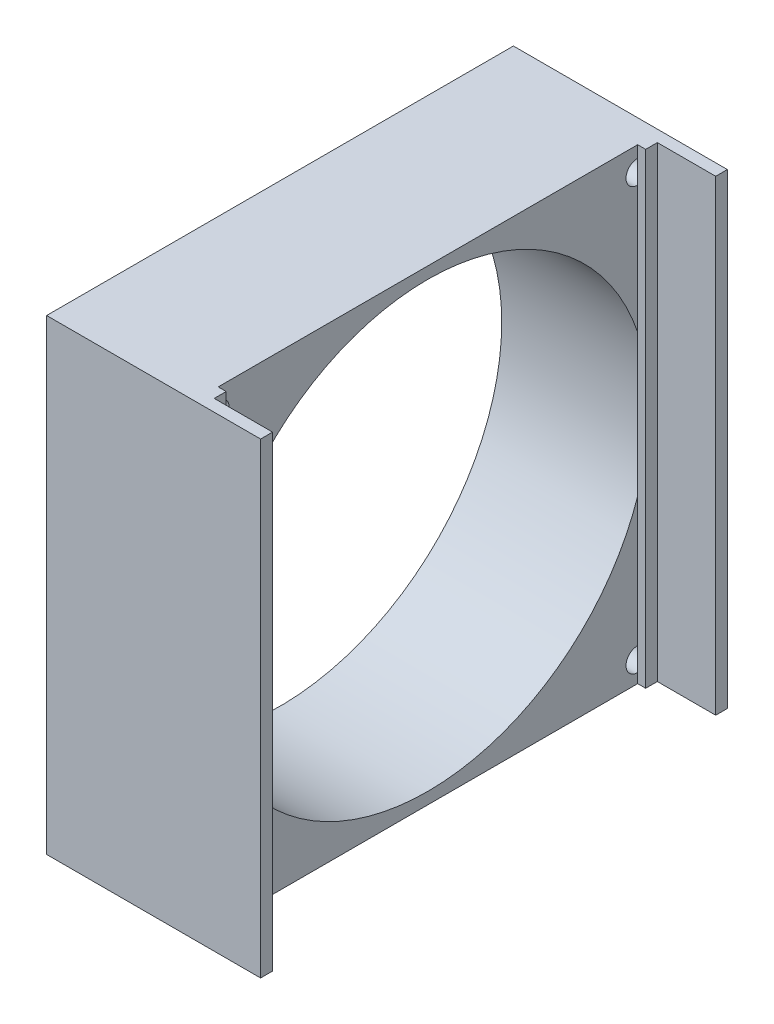
ISO-10303-21;
HEADER;
FILE_DESCRIPTION(('STEP AP214'),'2;1');
FILE_NAME('part.step','',(''),(''),'','','');
FILE_SCHEMA(('AUTOMOTIVE_DESIGN { 1 0 10303 214 1 1 1 1 }'));
ENDSEC;
DATA;
#1=APPLICATION_CONTEXT('core data for automotive mechanical design processes');
#2=APPLICATION_PROTOCOL_DEFINITION('international standard','automotive_design',2000,#1);
#3=PRODUCT_CONTEXT('',#1,'mechanical');
#4=PRODUCT('Part','Part','',(#3));
#5=PRODUCT_RELATED_PRODUCT_CATEGORY('part','',(#4));
#6=PRODUCT_DEFINITION_FORMATION('','',#4);
#7=PRODUCT_DEFINITION_CONTEXT('part definition',#1,'design');
#8=PRODUCT_DEFINITION('design','',#6,#7);
#9=PRODUCT_DEFINITION_SHAPE('','',#8);
#10=(LENGTH_UNIT() NAMED_UNIT(*) SI_UNIT(.MILLI.,.METRE.));
#11=(NAMED_UNIT(*) PLANE_ANGLE_UNIT() SI_UNIT($,.RADIAN.));
#12=(NAMED_UNIT(*) SI_UNIT($,.STERADIAN.) SOLID_ANGLE_UNIT());
#13=UNCERTAINTY_MEASURE_WITH_UNIT(LENGTH_MEASURE(1.E-05),#10,'distance_accuracy_value','');
#14=(GEOMETRIC_REPRESENTATION_CONTEXT(3) GLOBAL_UNCERTAINTY_ASSIGNED_CONTEXT((#13)) GLOBAL_UNIT_ASSIGNED_CONTEXT((#10,
#11,#12)) REPRESENTATION_CONTEXT('',''));
#15=CARTESIAN_POINT('',(0.,0.,0.));
#16=DIRECTION('',(0.,0.,1.));
#17=DIRECTION('',(1.,0.,0.));
#18=AXIS2_PLACEMENT_3D('',#15,#16,#17);
#19=CARTESIAN_POINT('',(26.67,-56.9430701752816,-42.0816882934185));
#20=DIRECTION('',(-1.,0.,0.));
#21=DIRECTION('',(0.,0.,1.));
#22=AXIS2_PLACEMENT_3D('',#19,#20,#21);
#23=PLANE('',#22);
#24=DIRECTION('',(0.,-1.,0.));
#25=VECTOR('',#24,1.);
#26=CARTESIAN_POINT('',(26.67,-56.9430701752816,-40.0816882934185));
#27=LINE('',#26,#25);
#28=CARTESIAN_POINT('',(26.67,23.0569298247184,-40.0816882934185));
#29=VERTEX_POINT('',#28);
#30=CARTESIAN_POINT('',(26.67,-56.9430701752816,-40.0816882934185));
#31=VERTEX_POINT('',#30);
#32=EDGE_CURVE('E55',#29,#31,#27,.T.);
#33=ORIENTED_EDGE('',*,*,#32,.F.);
#34=DIRECTION('',(0.,0.,1.));
#35=VECTOR('',#34,1.);
#36=CARTESIAN_POINT('',(26.67,23.0569298247184,-42.0816882934185));
#37=LINE('',#36,#35);
#38=CARTESIAN_POINT('',(26.67,23.0569298247184,-38.0816882934185));
#39=VERTEX_POINT('',#38);
#40=EDGE_CURVE('E215',#29,#39,#37,.T.);
#41=ORIENTED_EDGE('',*,*,#40,.T.);
#42=DIRECTION('',(0.,-1.,0.));
#43=VECTOR('',#42,1.);
#44=CARTESIAN_POINT('',(26.67,23.0569298247184,-38.0816882934185));
#45=LINE('',#44,#43);
#46=CARTESIAN_POINT('',(26.67,-56.9430701752816,-38.0816882934185));
#47=VERTEX_POINT('',#46);
#48=EDGE_CURVE('E217',#39,#47,#45,.T.);
#49=ORIENTED_EDGE('',*,*,#48,.T.);
#50=DIRECTION('',(0.,0.,-1.));
#51=VECTOR('',#50,1.);
#52=CARTESIAN_POINT('',(26.67,-56.9430701752816,-42.0816882934185));
#53=LINE('',#52,#51);
#54=EDGE_CURVE('E51',#47,#31,#53,.T.);
#55=ORIENTED_EDGE('',*,*,#54,.T.);
#56=EDGE_LOOP('',(#33,#41,#49,#55));
#57=FACE_BOUND('',#56,.T.);
#58=ADVANCED_FACE('F32',(#57),#23,.F.);
#59=CARTESIAN_POINT('',(26.67,-56.9430701752816,37.9183117065815));
#60=DIRECTION('',(1.,0.,0.));
#61=DIRECTION('',(0.,0.,-1.));
#62=AXIS2_PLACEMENT_3D('',#59,#60,#61);
#63=PLANE('',#62);
#64=DIRECTION('',(0.,0.,1.));
#65=VECTOR('',#64,1.);
#66=CARTESIAN_POINT('',(26.67,23.0569298247184,37.9183117065815));
#67=LINE('',#66,#65);
#68=CARTESIAN_POINT('',(26.67,23.0569298247184,33.8144309039734));
#69=VERTEX_POINT('',#68);
#70=CARTESIAN_POINT('',(26.67,23.0569298247184,35.8663713052775));
#71=VERTEX_POINT('',#70);
#72=EDGE_CURVE('E239',#69,#71,#67,.T.);
#73=ORIENTED_EDGE('',*,*,#72,.T.);
#74=DIRECTION('',(0.,1.,0.));
#75=VECTOR('',#74,1.);
#76=CARTESIAN_POINT('',(26.67,-56.9430701752816,35.8663713052775));
#77=LINE('',#76,#75);
#78=CARTESIAN_POINT('',(26.67,-56.9430701752816,35.8663713052775));
#79=VERTEX_POINT('',#78);
#80=EDGE_CURVE('E194',#79,#71,#77,.T.);
#81=ORIENTED_EDGE('',*,*,#80,.F.);
#82=DIRECTION('',(0.,0.,-1.));
#83=VECTOR('',#82,1.);
#84=CARTESIAN_POINT('',(26.67,-56.9430701752816,37.9183117065815));
#85=LINE('',#84,#83);
#86=CARTESIAN_POINT('',(26.67,-56.9430701752816,33.8144309039734));
#87=VERTEX_POINT('',#86);
#88=EDGE_CURVE('E234',#79,#87,#85,.T.);
#89=ORIENTED_EDGE('',*,*,#88,.T.);
#90=DIRECTION('',(0.,1.,0.));
#91=VECTOR('',#90,1.);
#92=CARTESIAN_POINT('',(26.67,23.0569298247184,33.8144309039734));
#93=LINE('',#92,#91);
#94=EDGE_CURVE('E236',#87,#69,#93,.T.);
#95=ORIENTED_EDGE('',*,*,#94,.T.);
#96=EDGE_LOOP('',(#73,#81,#89,#95));
#97=FACE_BOUND('',#96,.T.);
#98=ADVANCED_FACE('F334',(#97),#63,.T.);
#99=CARTESIAN_POINT('',(25.3,-56.9430701752816,37.9183117065815));
#100=DIRECTION('',(1.,0.,0.));
#101=DIRECTION('',(0.,0.,-1.));
#102=AXIS2_PLACEMENT_3D('',#99,#100,#101);
#103=PLANE('',#102);
#104=DIRECTION('',(0.,0.,-1.));
#105=VECTOR('',#104,1.);
#106=CARTESIAN_POINT('',(25.3,-56.9430701752816,37.9183117065815));
#107=LINE('',#106,#105);
#108=CARTESIAN_POINT('',(25.3,-56.9430701752816,33.8144309039734));
#109=VERTEX_POINT('',#108);
#110=CARTESIAN_POINT('',(25.3,-56.9430701752816,-38.0816882934185));
#111=VERTEX_POINT('',#110);
#112=EDGE_CURVE('E285',#109,#111,#107,.T.);
#113=ORIENTED_EDGE('',*,*,#112,.T.);
#114=DIRECTION('',(0.,-1.,0.));
#115=VECTOR('',#114,1.);
#116=CARTESIAN_POINT('',(25.3,23.0569298247184,-38.0816882934185));
#117=LINE('',#116,#115);
#118=CARTESIAN_POINT('',(25.3,-55.2831291642328,-38.0816882934185));
#119=VERTEX_POINT('',#118);
#120=EDGE_CURVE('E214',#119,#111,#117,.T.);
#121=ORIENTED_EDGE('',*,*,#120,.F.);
#122=CARTESIAN_POINT('',(25.3,-53.2831291642328,-38.0816882934185));
#123=DIRECTION('',(-1.,0.,0.));
#124=DIRECTION('',(0.,0.,1.));
#125=AXIS2_PLACEMENT_3D('',#122,#123,#124);
#126=CIRCLE('',#125,2.);
#127=CARTESIAN_POINT('',(25.3,-51.2831291642328,-38.0816882934185));
#128=VERTEX_POINT('',#127);
#129=EDGE_CURVE('E265',#119,#128,#126,.T.);
#130=ORIENTED_EDGE('',*,*,#129,.T.);
#131=CARTESIAN_POINT('',(25.3,-29.108595235878,-38.0816882934185));
#132=VERTEX_POINT('',#131);
#133=EDGE_CURVE('E603',#132,#128,#117,.T.);
#134=ORIENTED_EDGE('',*,*,#133,.F.);
#135=CARTESIAN_POINT('',(25.3,-16.9430701752816,-2.08168829341849));
#136=DIRECTION('',(1.,0.,0.));
#137=DIRECTION('',(0.,0.,-1.));
#138=AXIS2_PLACEMENT_3D('',#135,#136,#137);
#139=CIRCLE('',#138,38.);
#140=CARTESIAN_POINT('',(25.3,-29.4117760650936,33.8144309039734));
#141=VERTEX_POINT('',#140);
#142=EDGE_CURVE('E615',#141,#132,#139,.T.);
#143=ORIENTED_EDGE('',*,*,#142,.F.);
#144=DIRECTION('',(0.,1.,0.));
#145=VECTOR('',#144,1.);
#146=CARTESIAN_POINT('',(25.3,23.0569298247184,33.8144309039734));
#147=LINE('',#146,#145);
#148=CARTESIAN_POINT('',(25.3,-50.945769802566,33.8144309039734));
#149=VERTEX_POINT('',#148);
#150=EDGE_CURVE('E11',#149,#141,#147,.T.);
#151=ORIENTED_EDGE('',*,*,#150,.F.);
#152=CARTESIAN_POINT('',(25.3,-52.9430701752816,33.9183117065815));
#153=DIRECTION('',(-1.,0.,0.));
#154=DIRECTION('',(0.,0.,1.));
#155=AXIS2_PLACEMENT_3D('',#152,#153,#154);
#156=CIRCLE('',#155,2.);
#157=CARTESIAN_POINT('',(25.3,-54.9403705479971,33.8144309039734));
#158=VERTEX_POINT('',#157);
#159=EDGE_CURVE('E641',#149,#158,#156,.T.);
#160=ORIENTED_EDGE('',*,*,#159,.T.);
#161=EDGE_CURVE('E237',#109,#158,#147,.T.);
#162=ORIENTED_EDGE('',*,*,#161,.F.);
#163=EDGE_LOOP('',(#113,#121,#130,#134,#143,#151,#160,#162));
#164=FACE_BOUND('',#163,.T.);
#165=ADVANCED_FACE('F331',(#164),#103,.T.);
#166=CARTESIAN_POINT('',(25.3,-4.77754511468515,-38.0816882934185));
#167=VERTEX_POINT('',#166);
#168=CARTESIAN_POINT('',(25.3,-4.47436428546953,33.8144309039734));
#169=VERTEX_POINT('',#168);
#170=EDGE_CURVE('E609',#167,#169,#139,.T.);
#171=ORIENTED_EDGE('',*,*,#170,.F.);
#172=CARTESIAN_POINT('',(25.3,17.0569298247184,-38.0816882934185));
#173=VERTEX_POINT('',#172);
#174=EDGE_CURVE('E606',#173,#167,#117,.T.);
#175=ORIENTED_EDGE('',*,*,#174,.F.);
#176=CARTESIAN_POINT('',(25.3,19.0569298247184,-38.0816882934185));
#177=DIRECTION('',(-1.,0.,0.));
#178=DIRECTION('',(0.,0.,1.));
#179=AXIS2_PLACEMENT_3D('',#176,#177,#178);
#180=CIRCLE('',#179,2.);
#181=CARTESIAN_POINT('',(25.3,21.0569298247184,-38.0816882934185));
#182=VERTEX_POINT('',#181);
#183=EDGE_CURVE('E307',#173,#182,#180,.T.);
#184=ORIENTED_EDGE('',*,*,#183,.T.);
#185=CARTESIAN_POINT('',(25.3,23.0569298247184,-38.0816882934185));
#186=VERTEX_POINT('',#185);
#187=EDGE_CURVE('E218',#186,#182,#117,.T.);
#188=ORIENTED_EDGE('',*,*,#187,.F.);
#189=DIRECTION('',(0.,0.,1.));
#190=VECTOR('',#189,1.);
#191=CARTESIAN_POINT('',(25.3,23.0569298247184,37.9183117065815));
#192=LINE('',#191,#190);
#193=CARTESIAN_POINT('',(25.3,23.0569298247184,33.8144309039734));
#194=VERTEX_POINT('',#193);
#195=EDGE_CURVE('E36',#186,#194,#192,.T.);
#196=ORIENTED_EDGE('',*,*,#195,.T.);
#197=CARTESIAN_POINT('',(25.3,21.0542301974339,33.8144309039734));
#198=VERTEX_POINT('',#197);
#199=EDGE_CURVE('E249',#198,#194,#147,.T.);
#200=ORIENTED_EDGE('',*,*,#199,.F.);
#201=CARTESIAN_POINT('',(25.3,19.0569298247184,33.9183117065815));
#202=DIRECTION('',(-1.,0.,0.));
#203=DIRECTION('',(0.,0.,1.));
#204=AXIS2_PLACEMENT_3D('',#201,#202,#203);
#205=CIRCLE('',#204,2.);
#206=CARTESIAN_POINT('',(25.3,17.0596294520029,33.8144309039734));
#207=VERTEX_POINT('',#206);
#208=EDGE_CURVE('E621',#198,#207,#205,.T.);
#209=ORIENTED_EDGE('',*,*,#208,.T.);
#210=EDGE_CURVE('E42',#169,#207,#147,.T.);
#211=ORIENTED_EDGE('',*,*,#210,.F.);
#212=EDGE_LOOP('',(#171,#175,#184,#188,#196,#200,#209,#211));
#213=FACE_BOUND('',#212,.T.);
#214=ADVANCED_FACE('F305',(#213),#103,.T.);
#215=CARTESIAN_POINT('',(25.3,23.0569298247184,37.9183117065815));
#216=DIRECTION('',(0.,0.,-1.));
#217=DIRECTION('',(0.,1.,0.));
#218=AXIS2_PLACEMENT_3D('',#215,#216,#217);
#219=PLANE('',#218);
#220=DIRECTION('',(0.,-1.,0.));
#221=VECTOR('',#220,1.);
#222=CARTESIAN_POINT('',(0.,23.0569298247184,37.9183117065815));
#223=LINE('',#222,#221);
#224=CARTESIAN_POINT('',(0.,23.0569298247184,37.9183117065815));
#225=VERTEX_POINT('',#224);
#226=CARTESIAN_POINT('',(0.,-56.9430701752816,37.9183117065815));
#227=VERTEX_POINT('',#226);
#228=EDGE_CURVE('E294',#225,#227,#223,.T.);
#229=ORIENTED_EDGE('',*,*,#228,.T.);
#230=DIRECTION('',(-1.,0.,0.));
#231=VECTOR('',#230,1.);
#232=CARTESIAN_POINT('',(25.3,-56.9430701752816,37.9183117065815));
#233=LINE('',#232,#231);
#234=CARTESIAN_POINT('',(36.67,-56.9430701752816,37.9183117065815));
#235=VERTEX_POINT('',#234);
#236=EDGE_CURVE('E278',#235,#227,#233,.T.);
#237=ORIENTED_EDGE('',*,*,#236,.F.);
#238=DIRECTION('',(0.,-1.,0.));
#239=VECTOR('',#238,1.);
#240=CARTESIAN_POINT('',(36.67,-56.9430701752816,37.9183117065815));
#241=LINE('',#240,#239);
#242=CARTESIAN_POINT('',(36.67,23.0569298247184,37.9183117065815));
#243=VERTEX_POINT('',#242);
#244=EDGE_CURVE('E201',#243,#235,#241,.T.);
#245=ORIENTED_EDGE('',*,*,#244,.F.);
#246=DIRECTION('',(-1.,0.,0.));
#247=VECTOR('',#246,1.);
#248=CARTESIAN_POINT('',(25.3,23.0569298247184,37.9183117065815));
#249=LINE('',#248,#247);
#250=EDGE_CURVE('E170',#243,#225,#249,.T.);
#251=ORIENTED_EDGE('',*,*,#250,.T.);
#252=EDGE_LOOP('',(#229,#237,#245,#251));
#253=FACE_BOUND('',#252,.T.);
#254=ADVANCED_FACE('F34',(#253),#219,.F.);
#255=CARTESIAN_POINT('',(25.3,-56.9430701752816,37.9183117065815));
#256=DIRECTION('',(0.,1.,0.));
#257=DIRECTION('',(0.,0.,1.));
#258=AXIS2_PLACEMENT_3D('',#255,#256,#257);
#259=PLANE('',#258);
#260=DIRECTION('',(0.,0.,-1.));
#261=VECTOR('',#260,1.);
#262=CARTESIAN_POINT('',(0.,-56.9430701752816,37.9183117065815));
#263=LINE('',#262,#261);
#264=CARTESIAN_POINT('',(0.,-56.9430701752816,-42.0816882934185));
#265=VERTEX_POINT('',#264);
#266=EDGE_CURVE('E296',#227,#265,#263,.T.);
#267=ORIENTED_EDGE('',*,*,#266,.T.);
#268=DIRECTION('',(-1.,0.,0.));
#269=VECTOR('',#268,1.);
#270=CARTESIAN_POINT('',(25.3,-56.9430701752816,-42.0816882934185));
#271=LINE('',#270,#269);
#272=CARTESIAN_POINT('',(36.67,-56.9430701752816,-42.0816882934185));
#273=VERTEX_POINT('',#272);
#274=EDGE_CURVE('E169',#273,#265,#271,.T.);
#275=ORIENTED_EDGE('',*,*,#274,.F.);
#276=DIRECTION('',(0.,0.,-1.));
#277=VECTOR('',#276,1.);
#278=CARTESIAN_POINT('',(36.67,-56.9430701752816,-42.0816882934185));
#279=LINE('',#278,#277);
#280=CARTESIAN_POINT('',(36.67,-56.9430701752816,-40.0816882934185));
#281=VERTEX_POINT('',#280);
#282=EDGE_CURVE('E184',#281,#273,#279,.T.);
#283=ORIENTED_EDGE('',*,*,#282,.F.);
#284=DIRECTION('',(-1.,0.,0.));
#285=VECTOR('',#284,1.);
#286=CARTESIAN_POINT('',(36.67,-56.9430701752816,-40.0816882934185));
#287=LINE('',#286,#285);
#288=EDGE_CURVE('E189',#281,#31,#287,.T.);
#289=ORIENTED_EDGE('',*,*,#288,.T.);
#290=ORIENTED_EDGE('',*,*,#54,.F.);
#291=DIRECTION('',(-1.,0.,0.));
#292=VECTOR('',#291,1.);
#293=CARTESIAN_POINT('',(26.67,-56.9430701752816,-38.0816882934185));
#294=LINE('',#293,#292);
#295=EDGE_CURVE('E221',#47,#111,#294,.T.);
#296=ORIENTED_EDGE('',*,*,#295,.T.);
#297=ORIENTED_EDGE('',*,*,#112,.F.);
#298=DIRECTION('',(-1.,0.,0.));
#299=VECTOR('',#298,1.);
#300=CARTESIAN_POINT('',(26.67,-56.9430701752816,33.8144309039734));
#301=LINE('',#300,#299);
#302=EDGE_CURVE('E257',#87,#109,#301,.T.);
#303=ORIENTED_EDGE('',*,*,#302,.F.);
#304=ORIENTED_EDGE('',*,*,#88,.F.);
#305=DIRECTION('',(-1.,0.,0.));
#306=VECTOR('',#305,1.);
#307=CARTESIAN_POINT('',(36.67,-56.9430701752816,35.8663713052775));
#308=LINE('',#307,#306);
#309=CARTESIAN_POINT('',(36.67,-56.9430701752816,35.8663713052775));
#310=VERTEX_POINT('',#309);
#311=EDGE_CURVE('E206',#310,#79,#308,.T.);
#312=ORIENTED_EDGE('',*,*,#311,.F.);
#313=DIRECTION('',(0.,0.,-1.));
#314=VECTOR('',#313,1.);
#315=CARTESIAN_POINT('',(36.67,-56.9430701752816,35.8663713052775));
#316=LINE('',#315,#314);
#317=EDGE_CURVE('E204',#235,#310,#316,.T.);
#318=ORIENTED_EDGE('',*,*,#317,.F.);
#319=ORIENTED_EDGE('',*,*,#236,.T.);
#320=EDGE_LOOP('',(#267,#275,#283,#289,#290,#296,#297,#303,#304,#312,#318,#319));
#321=FACE_BOUND('',#320,.T.);
#322=ADVANCED_FACE('F319',(#321),#259,.F.);
#323=CARTESIAN_POINT('',(25.3,23.0569298247184,-42.0816882934185));
#324=DIRECTION('',(0.,0.,1.));
#325=DIRECTION('',(0.,-1.,0.));
#326=AXIS2_PLACEMENT_3D('',#323,#324,#325);
#327=PLANE('',#326);
#328=DIRECTION('',(0.,1.,0.));
#329=VECTOR('',#328,1.);
#330=CARTESIAN_POINT('',(0.,23.0569298247184,-42.0816882934185));
#331=LINE('',#330,#329);
#332=CARTESIAN_POINT('',(0.,23.0569298247184,-42.0816882934185));
#333=VERTEX_POINT('',#332);
#334=EDGE_CURVE('E166',#265,#333,#331,.T.);
#335=ORIENTED_EDGE('',*,*,#334,.T.);
#336=DIRECTION('',(-1.,0.,0.));
#337=VECTOR('',#336,1.);
#338=CARTESIAN_POINT('',(25.3,23.0569298247184,-42.0816882934185));
#339=LINE('',#338,#337);
#340=CARTESIAN_POINT('',(36.67,23.0569298247184,-42.0816882934185));
#341=VERTEX_POINT('',#340);
#342=EDGE_CURVE('E159',#341,#333,#339,.T.);
#343=ORIENTED_EDGE('',*,*,#342,.F.);
#344=DIRECTION('',(0.,1.,0.));
#345=VECTOR('',#344,1.);
#346=CARTESIAN_POINT('',(36.67,-56.9430701752816,-42.0816882934185));
#347=LINE('',#346,#345);
#348=EDGE_CURVE('E164',#273,#341,#347,.T.);
#349=ORIENTED_EDGE('',*,*,#348,.F.);
#350=ORIENTED_EDGE('',*,*,#274,.T.);
#351=EDGE_LOOP('',(#335,#343,#349,#350));
#352=FACE_BOUND('',#351,.T.);
#353=ADVANCED_FACE('F161',(#352),#327,.F.);
#354=CARTESIAN_POINT('',(25.3,23.0569298247184,37.9183117065815));
#355=DIRECTION('',(0.,-1.,0.));
#356=DIRECTION('',(0.,0.,-1.));
#357=AXIS2_PLACEMENT_3D('',#354,#355,#356);
#358=PLANE('',#357);
#359=DIRECTION('',(0.,0.,1.));
#360=VECTOR('',#359,1.);
#361=CARTESIAN_POINT('',(0.,23.0569298247184,37.9183117065815));
#362=LINE('',#361,#360);
#363=EDGE_CURVE('E287',#333,#225,#362,.T.);
#364=ORIENTED_EDGE('',*,*,#363,.T.);
#365=ORIENTED_EDGE('',*,*,#250,.F.);
#366=DIRECTION('',(0.,0.,1.));
#367=VECTOR('',#366,1.);
#368=CARTESIAN_POINT('',(36.67,23.0569298247184,35.8663713052775));
#369=LINE('',#368,#367);
#370=CARTESIAN_POINT('',(36.67,23.0569298247184,35.8663713052775));
#371=VERTEX_POINT('',#370);
#372=EDGE_CURVE('E198',#371,#243,#369,.T.);
#373=ORIENTED_EDGE('',*,*,#372,.F.);
#374=DIRECTION('',(-1.,0.,0.));
#375=VECTOR('',#374,1.);
#376=CARTESIAN_POINT('',(36.67,23.0569298247184,35.8663713052775));
#377=LINE('',#376,#375);
#378=EDGE_CURVE('E211',#371,#71,#377,.T.);
#379=ORIENTED_EDGE('',*,*,#378,.T.);
#380=ORIENTED_EDGE('',*,*,#72,.F.);
#381=DIRECTION('',(-1.,0.,0.));
#382=VECTOR('',#381,1.);
#383=CARTESIAN_POINT('',(26.67,23.0569298247184,33.8144309039734));
#384=LINE('',#383,#382);
#385=EDGE_CURVE('E240',#69,#194,#384,.T.);
#386=ORIENTED_EDGE('',*,*,#385,.T.);
#387=ORIENTED_EDGE('',*,*,#195,.F.);
#388=DIRECTION('',(-1.,0.,0.));
#389=VECTOR('',#388,1.);
#390=CARTESIAN_POINT('',(26.67,23.0569298247184,-38.0816882934185));
#391=LINE('',#390,#389);
#392=EDGE_CURVE('E227',#39,#186,#391,.T.);
#393=ORIENTED_EDGE('',*,*,#392,.F.);
#394=ORIENTED_EDGE('',*,*,#40,.F.);
#395=DIRECTION('',(-1.,0.,0.));
#396=VECTOR('',#395,1.);
#397=CARTESIAN_POINT('',(36.67,23.0569298247184,-40.0816882934185));
#398=LINE('',#397,#396);
#399=CARTESIAN_POINT('',(36.67,23.0569298247184,-40.0816882934185));
#400=VERTEX_POINT('',#399);
#401=EDGE_CURVE('E176',#400,#29,#398,.T.);
#402=ORIENTED_EDGE('',*,*,#401,.F.);
#403=DIRECTION('',(0.,0.,1.));
#404=VECTOR('',#403,1.);
#405=CARTESIAN_POINT('',(36.67,23.0569298247184,-42.0816882934185));
#406=LINE('',#405,#404);
#407=EDGE_CURVE('E173',#341,#400,#406,.T.);
#408=ORIENTED_EDGE('',*,*,#407,.F.);
#409=ORIENTED_EDGE('',*,*,#342,.T.);
#410=EDGE_LOOP('',(#364,#365,#373,#379,#380,#386,#387,#393,#394,#402,#408,#409));
#411=FACE_BOUND('',#410,.T.);
#412=ADVANCED_FACE('F174',(#411),#358,.F.);
#413=CARTESIAN_POINT('',(0.,-56.9430701752816,37.9183117065815));
#414=DIRECTION('',(1.,0.,0.));
#415=DIRECTION('',(0.,0.,-1.));
#416=AXIS2_PLACEMENT_3D('',#413,#414,#415);
#417=PLANE('',#416);
#418=CARTESIAN_POINT('',(0.,-53.2831291642328,-38.0816882934185));
#419=DIRECTION('',(-1.,0.,0.));
#420=DIRECTION('',(0.,0.,1.));
#421=AXIS2_PLACEMENT_3D('',#418,#419,#420);
#422=CIRCLE('',#421,2.);
#423=CARTESIAN_POINT('',(0.,-53.2831291642328,-36.0816882934185));
#424=VERTEX_POINT('',#423);
#425=EDGE_CURVE('E259',#424,#424,#422,.T.);
#426=ORIENTED_EDGE('',*,*,#425,.F.);
#427=EDGE_LOOP('',(#426));
#428=FACE_BOUND('',#427,.T.);
#429=CARTESIAN_POINT('',(0.,-52.9430701752816,33.9183117065815));
#430=DIRECTION('',(-1.,0.,0.));
#431=DIRECTION('',(0.,0.,1.));
#432=AXIS2_PLACEMENT_3D('',#429,#430,#431);
#433=CIRCLE('',#432,2.);
#434=CARTESIAN_POINT('',(0.,-52.9430701752816,35.9183117065815));
#435=VERTEX_POINT('',#434);
#436=EDGE_CURVE('E634',#435,#435,#433,.T.);
#437=ORIENTED_EDGE('',*,*,#436,.F.);
#438=EDGE_LOOP('',(#437));
#439=FACE_BOUND('',#438,.T.);
#440=CARTESIAN_POINT('',(0.,19.0569298247184,33.9183117065815));
#441=DIRECTION('',(-1.,0.,0.));
#442=DIRECTION('',(0.,0.,1.));
#443=AXIS2_PLACEMENT_3D('',#440,#441,#442);
#444=CIRCLE('',#443,2.);
#445=CARTESIAN_POINT('',(0.,19.0569298247184,35.9183117065815));
#446=VERTEX_POINT('',#445);
#447=EDGE_CURVE('E618',#446,#446,#444,.T.);
#448=ORIENTED_EDGE('',*,*,#447,.F.);
#449=EDGE_LOOP('',(#448));
#450=FACE_BOUND('',#449,.T.);
#451=CARTESIAN_POINT('',(0.,19.0569298247184,-38.0816882934185));
#452=DIRECTION('',(-1.,0.,0.));
#453=DIRECTION('',(0.,0.,1.));
#454=AXIS2_PLACEMENT_3D('',#451,#452,#453);
#455=CIRCLE('',#454,2.);
#456=CARTESIAN_POINT('',(0.,19.0569298247184,-36.0816882934185));
#457=VERTEX_POINT('',#456);
#458=EDGE_CURVE('E613',#457,#457,#455,.T.);
#459=ORIENTED_EDGE('',*,*,#458,.F.);
#460=EDGE_LOOP('',(#459));
#461=FACE_BOUND('',#460,.T.);
#462=CARTESIAN_POINT('',(0.,-16.9430701752816,-2.08168829341849));
#463=DIRECTION('',(1.,0.,0.));
#464=DIRECTION('',(0.,0.,-1.));
#465=AXIS2_PLACEMENT_3D('',#462,#463,#464);
#466=CIRCLE('',#465,38.);
#467=CARTESIAN_POINT('',(0.,-16.9430701752816,-40.0816882934185));
#468=VERTEX_POINT('',#467);
#469=EDGE_CURVE('E297',#468,#468,#466,.T.);
#470=ORIENTED_EDGE('',*,*,#469,.T.);
#471=EDGE_LOOP('',(#470));
#472=FACE_BOUND('',#471,.T.);
#473=ORIENTED_EDGE('',*,*,#228,.F.);
#474=ORIENTED_EDGE('',*,*,#363,.F.);
#475=ORIENTED_EDGE('',*,*,#334,.F.);
#476=ORIENTED_EDGE('',*,*,#266,.F.);
#477=EDGE_LOOP('',(#473,#474,#475,#476));
#478=FACE_BOUND('',#477,.T.);
#479=ADVANCED_FACE('F321',(#428,#439,#450,#461,#472,#478),#417,.F.);
#480=CARTESIAN_POINT('',(0.,-16.9430701752816,-2.08168829341849));
#481=DIRECTION('',(1.,0.,0.));
#482=DIRECTION('',(0.,0.,-1.));
#483=AXIS2_PLACEMENT_3D('',#480,#481,#482);
#484=CYLINDRICAL_SURFACE('',#483,38.);
#485=ORIENTED_EDGE('',*,*,#469,.F.);
#486=EDGE_LOOP('',(#485));
#487=FACE_BOUND('',#486,.T.);
#488=EDGE_CURVE('E290',#169,#141,#139,.T.);
#489=ORIENTED_EDGE('',*,*,#488,.T.);
#490=ORIENTED_EDGE('',*,*,#142,.T.);
#491=CARTESIAN_POINT('',(25.3,-16.9430701752816,-2.08168829341849));
#492=DIRECTION('',(-1.,0.,0.));
#493=DIRECTION('',(0.,0.,1.));
#494=AXIS2_PLACEMENT_3D('',#491,#492,#493);
#495=CIRCLE('',#494,38.);
#496=EDGE_CURVE('E230',#132,#167,#495,.F.);
#497=ORIENTED_EDGE('',*,*,#496,.T.);
#498=ORIENTED_EDGE('',*,*,#170,.T.);
#499=EDGE_LOOP('',(#489,#490,#497,#498));
#500=FACE_BOUND('',#499,.T.);
#501=ADVANCED_FACE('F376',(#487,#500),#484,.F.);
#502=CARTESIAN_POINT('',(25.3,19.0569298247184,-38.0816882934185));
#503=DIRECTION('',(-1.,0.,0.));
#504=DIRECTION('',(0.,0.,1.));
#505=AXIS2_PLACEMENT_3D('',#502,#503,#504);
#506=CYLINDRICAL_SURFACE('',#505,2.);
#507=EDGE_CURVE('E612',#182,#173,#180,.T.);
#508=ORIENTED_EDGE('',*,*,#507,.F.);
#509=ORIENTED_EDGE('',*,*,#183,.F.);
#510=EDGE_LOOP('',(#508,#509));
#511=FACE_BOUND('',#510,.T.);
#512=ORIENTED_EDGE('',*,*,#458,.T.);
#513=EDGE_LOOP('',(#512));
#514=FACE_BOUND('',#513,.T.);
#515=ADVANCED_FACE('F372',(#511,#514),#506,.F.);
#516=CARTESIAN_POINT('',(25.3,19.0569298247184,33.9183117065815));
#517=DIRECTION('',(-1.,0.,0.));
#518=DIRECTION('',(0.,0.,1.));
#519=AXIS2_PLACEMENT_3D('',#516,#517,#518);
#520=CYLINDRICAL_SURFACE('',#519,2.);
#521=ORIENTED_EDGE('',*,*,#208,.F.);
#522=EDGE_CURVE('E643',#207,#198,#205,.T.);
#523=ORIENTED_EDGE('',*,*,#522,.F.);
#524=EDGE_LOOP('',(#521,#523));
#525=FACE_BOUND('',#524,.T.);
#526=ORIENTED_EDGE('',*,*,#447,.T.);
#527=EDGE_LOOP('',(#526));
#528=FACE_BOUND('',#527,.T.);
#529=ADVANCED_FACE('F368',(#525,#528),#520,.F.);
#530=CARTESIAN_POINT('',(25.3,-52.9430701752816,33.9183117065815));
#531=DIRECTION('',(-1.,0.,0.));
#532=DIRECTION('',(0.,0.,1.));
#533=AXIS2_PLACEMENT_3D('',#530,#531,#532);
#534=CYLINDRICAL_SURFACE('',#533,2.);
#535=ORIENTED_EDGE('',*,*,#159,.F.);
#536=EDGE_CURVE('E636',#158,#149,#156,.T.);
#537=ORIENTED_EDGE('',*,*,#536,.F.);
#538=EDGE_LOOP('',(#535,#537));
#539=FACE_BOUND('',#538,.T.);
#540=ORIENTED_EDGE('',*,*,#436,.T.);
#541=EDGE_LOOP('',(#540));
#542=FACE_BOUND('',#541,.T.);
#543=ADVANCED_FACE('F364',(#539,#542),#534,.F.);
#544=CARTESIAN_POINT('',(25.3,-53.2831291642328,-38.0816882934185));
#545=DIRECTION('',(-1.,0.,0.));
#546=DIRECTION('',(0.,0.,1.));
#547=AXIS2_PLACEMENT_3D('',#544,#545,#546);
#548=CYLINDRICAL_SURFACE('',#547,2.);
#549=EDGE_CURVE('E245',#128,#119,#126,.T.);
#550=ORIENTED_EDGE('',*,*,#549,.F.);
#551=ORIENTED_EDGE('',*,*,#129,.F.);
#552=EDGE_LOOP('',(#550,#551));
#553=FACE_BOUND('',#552,.T.);
#554=ORIENTED_EDGE('',*,*,#425,.T.);
#555=EDGE_LOOP('',(#554));
#556=FACE_BOUND('',#555,.T.);
#557=ADVANCED_FACE('F361',(#553,#556),#548,.F.);
#558=CARTESIAN_POINT('',(25.3,-56.9430701752816,37.9183117065815));
#559=DIRECTION('',(1.,0.,0.));
#560=DIRECTION('',(0.,0.,-1.));
#561=AXIS2_PLACEMENT_3D('',#558,#559,#560);
#562=PLANE('',#561);
#563=EDGE_CURVE('E44',#158,#149,#147,.T.);
#564=ORIENTED_EDGE('',*,*,#563,.F.);
#565=ORIENTED_EDGE('',*,*,#536,.T.);
#566=EDGE_LOOP('',(#564,#565));
#567=FACE_BOUND('',#566,.T.);
#568=ADVANCED_FACE('F357',(#567),#562,.F.);
#569=EDGE_CURVE('E233',#207,#198,#147,.T.);
#570=ORIENTED_EDGE('',*,*,#569,.F.);
#571=ORIENTED_EDGE('',*,*,#522,.T.);
#572=EDGE_LOOP('',(#570,#571));
#573=FACE_BOUND('',#572,.T.);
#574=ADVANCED_FACE('F358',(#573),#562,.F.);
#575=CARTESIAN_POINT('',(26.67,23.0569298247184,33.8144309039734));
#576=DIRECTION('',(0.,0.,1.));
#577=DIRECTION('',(1.,0.,0.));
#578=AXIS2_PLACEMENT_3D('',#575,#576,#577);
#579=PLANE('',#578);
#580=ORIENTED_EDGE('',*,*,#161,.T.);
#581=ORIENTED_EDGE('',*,*,#563,.T.);
#582=ORIENTED_EDGE('',*,*,#150,.T.);
#583=EDGE_CURVE('E244',#141,#169,#147,.T.);
#584=ORIENTED_EDGE('',*,*,#583,.T.);
#585=ORIENTED_EDGE('',*,*,#210,.T.);
#586=ORIENTED_EDGE('',*,*,#569,.T.);
#587=ORIENTED_EDGE('',*,*,#199,.T.);
#588=ORIENTED_EDGE('',*,*,#385,.F.);
#589=ORIENTED_EDGE('',*,*,#94,.F.);
#590=ORIENTED_EDGE('',*,*,#302,.T.);
#591=EDGE_LOOP('',(#580,#581,#582,#584,#585,#586,#587,#588,#589,#590));
#592=FACE_BOUND('',#591,.T.);
#593=ADVANCED_FACE('F272',(#592),#579,.F.);
#594=ORIENTED_EDGE('',*,*,#488,.F.);
#595=ORIENTED_EDGE('',*,*,#583,.F.);
#596=EDGE_LOOP('',(#594,#595));
#597=FACE_BOUND('',#596,.T.);
#598=ADVANCED_FACE('F349',(#597),#562,.F.);
#599=CARTESIAN_POINT('',(25.3,-56.9430701752816,-42.0816882934185));
#600=DIRECTION('',(-1.,0.,0.));
#601=DIRECTION('',(0.,0.,1.));
#602=AXIS2_PLACEMENT_3D('',#599,#600,#601);
#603=PLANE('',#602);
#604=ORIENTED_EDGE('',*,*,#496,.F.);
#605=EDGE_CURVE('E604',#167,#132,#117,.T.);
#606=ORIENTED_EDGE('',*,*,#605,.F.);
#607=EDGE_LOOP('',(#604,#606));
#608=FACE_BOUND('',#607,.T.);
#609=ADVANCED_FACE('F345',(#608),#603,.T.);
#610=ORIENTED_EDGE('',*,*,#507,.T.);
#611=EDGE_CURVE('E224',#182,#173,#117,.T.);
#612=ORIENTED_EDGE('',*,*,#611,.F.);
#613=EDGE_LOOP('',(#610,#612));
#614=FACE_BOUND('',#613,.T.);
#615=ADVANCED_FACE('F348',(#614),#603,.T.);
#616=ORIENTED_EDGE('',*,*,#549,.T.);
#617=EDGE_CURVE('E602',#128,#119,#117,.T.);
#618=ORIENTED_EDGE('',*,*,#617,.F.);
#619=EDGE_LOOP('',(#616,#618));
#620=FACE_BOUND('',#619,.T.);
#621=ADVANCED_FACE('F351',(#620),#603,.T.);
#622=CARTESIAN_POINT('',(26.67,23.0569298247184,-38.0816882934185));
#623=DIRECTION('',(0.,0.,-1.));
#624=DIRECTION('',(-1.,0.,0.));
#625=AXIS2_PLACEMENT_3D('',#622,#623,#624);
#626=PLANE('',#625);
#627=ORIENTED_EDGE('',*,*,#187,.T.);
#628=ORIENTED_EDGE('',*,*,#611,.T.);
#629=ORIENTED_EDGE('',*,*,#174,.T.);
#630=ORIENTED_EDGE('',*,*,#605,.T.);
#631=ORIENTED_EDGE('',*,*,#133,.T.);
#632=ORIENTED_EDGE('',*,*,#617,.T.);
#633=ORIENTED_EDGE('',*,*,#120,.T.);
#634=ORIENTED_EDGE('',*,*,#295,.F.);
#635=ORIENTED_EDGE('',*,*,#48,.F.);
#636=ORIENTED_EDGE('',*,*,#392,.T.);
#637=EDGE_LOOP('',(#627,#628,#629,#630,#631,#632,#633,#634,#635,#636));
#638=FACE_BOUND('',#637,.T.);
#639=ADVANCED_FACE('F311',(#638),#626,.F.);
#640=CARTESIAN_POINT('',(36.67,-56.9430701752816,35.8663713052775));
#641=DIRECTION('',(0.,0.,1.));
#642=DIRECTION('',(1.,0.,0.));
#643=AXIS2_PLACEMENT_3D('',#640,#641,#642);
#644=PLANE('',#643);
#645=ORIENTED_EDGE('',*,*,#80,.T.);
#646=ORIENTED_EDGE('',*,*,#378,.F.);
#647=DIRECTION('',(0.,1.,0.));
#648=VECTOR('',#647,1.);
#649=CARTESIAN_POINT('',(36.67,-56.9430701752816,35.8663713052775));
#650=LINE('',#649,#648);
#651=EDGE_CURVE('E195',#310,#371,#650,.T.);
#652=ORIENTED_EDGE('',*,*,#651,.F.);
#653=ORIENTED_EDGE('',*,*,#311,.T.);
#654=EDGE_LOOP('',(#645,#646,#652,#653));
#655=FACE_BOUND('',#654,.T.);
#656=ADVANCED_FACE('F343',(#655),#644,.F.);
#657=CARTESIAN_POINT('',(36.67,23.0569298247184,35.8663713052775));
#658=DIRECTION('',(1.,0.,0.));
#659=DIRECTION('',(0.,0.,-1.));
#660=AXIS2_PLACEMENT_3D('',#657,#658,#659);
#661=PLANE('',#660);
#662=ORIENTED_EDGE('',*,*,#651,.T.);
#663=ORIENTED_EDGE('',*,*,#372,.T.);
#664=ORIENTED_EDGE('',*,*,#244,.T.);
#665=ORIENTED_EDGE('',*,*,#317,.T.);
#666=EDGE_LOOP('',(#662,#663,#664,#665));
#667=FACE_BOUND('',#666,.T.);
#668=ADVANCED_FACE('F323',(#667),#661,.T.);
#669=CARTESIAN_POINT('',(36.67,-56.9430701752816,-40.0816882934185));
#670=DIRECTION('',(0.,0.,-1.));
#671=DIRECTION('',(-1.,0.,0.));
#672=AXIS2_PLACEMENT_3D('',#669,#670,#671);
#673=PLANE('',#672);
#674=ORIENTED_EDGE('',*,*,#32,.T.);
#675=ORIENTED_EDGE('',*,*,#288,.F.);
#676=DIRECTION('',(0.,-1.,0.));
#677=VECTOR('',#676,1.);
#678=CARTESIAN_POINT('',(36.67,-56.9430701752816,-40.0816882934185));
#679=LINE('',#678,#677);
#680=EDGE_CURVE('E179',#400,#281,#679,.T.);
#681=ORIENTED_EDGE('',*,*,#680,.F.);
#682=ORIENTED_EDGE('',*,*,#401,.T.);
#683=EDGE_LOOP('',(#674,#675,#681,#682));
#684=FACE_BOUND('',#683,.T.);
#685=ADVANCED_FACE('F317',(#684),#673,.F.);
#686=CARTESIAN_POINT('',(36.67,23.0569298247184,-42.0816882934185));
#687=DIRECTION('',(1.,0.,0.));
#688=DIRECTION('',(0.,0.,-1.));
#689=AXIS2_PLACEMENT_3D('',#686,#687,#688);
#690=PLANE('',#689);
#691=ORIENTED_EDGE('',*,*,#348,.T.);
#692=ORIENTED_EDGE('',*,*,#407,.T.);
#693=ORIENTED_EDGE('',*,*,#680,.T.);
#694=ORIENTED_EDGE('',*,*,#282,.T.);
#695=EDGE_LOOP('',(#691,#692,#693,#694));
#696=FACE_BOUND('',#695,.T.);
#697=ADVANCED_FACE('F182',(#696),#690,.T.);
#698=CLOSED_SHELL('',(#58,#98,#165,#214,#254,#322,#353,#412,#479,#501,#515,#529,#543,#557,#568,
#574,#593,#598,#609,#615,#621,#639,#656,#668,#685,#697));
#699=MANIFOLD_SOLID_BREP('B2',#698);
#700=ADVANCED_BREP_SHAPE_REPRESENTATION('',(#18,#699),#14);
#701=SHAPE_DEFINITION_REPRESENTATION(#9,#700);
ENDSEC;
END-ISO-10303-21;
